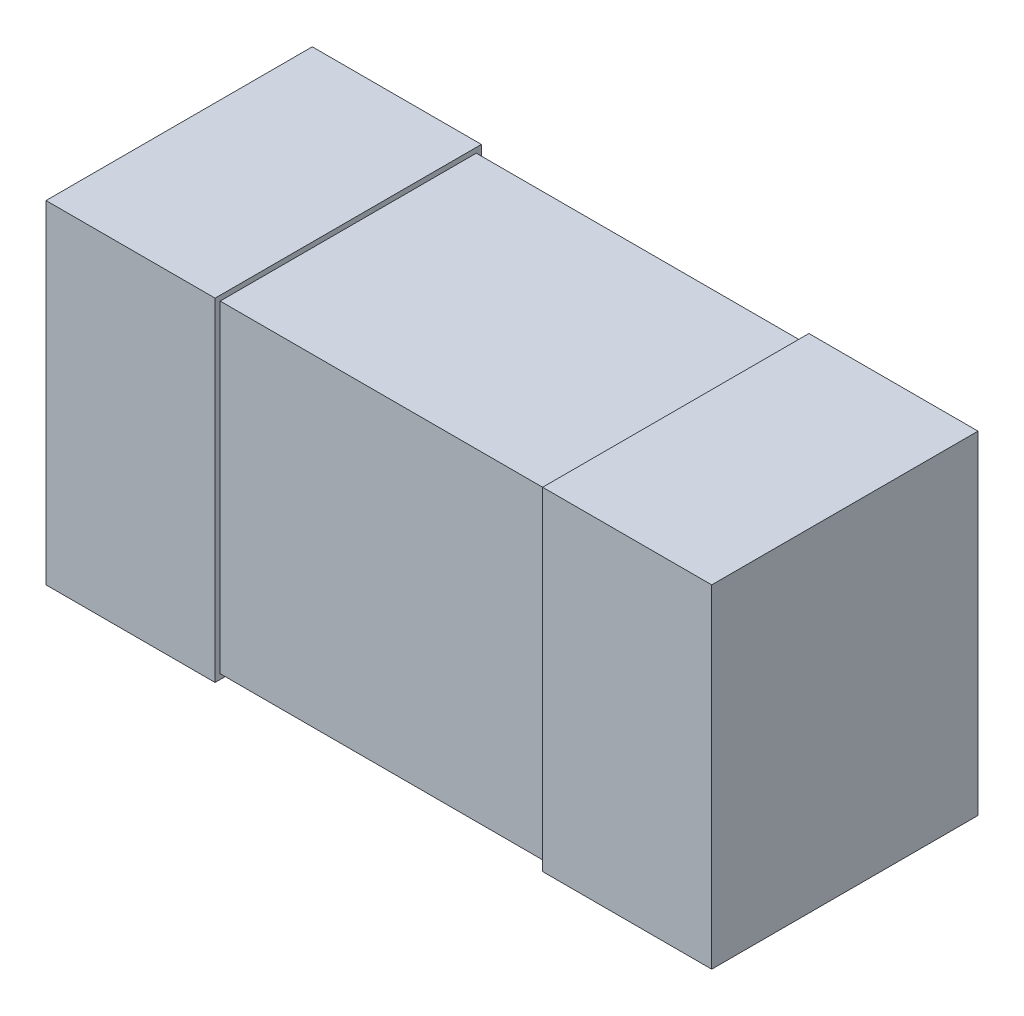
ISO-10303-21;
HEADER;
FILE_DESCRIPTION(('STEP AP214'),'2;1');
FILE_NAME('part.step','',(''),(''),'','','');
FILE_SCHEMA(('AUTOMOTIVE_DESIGN { 1 0 10303 214 1 1 1 1 }'));
ENDSEC;
DATA;
#1=APPLICATION_CONTEXT('core data for automotive mechanical design processes');
#2=APPLICATION_PROTOCOL_DEFINITION('international standard','automotive_design',2000,#1);
#3=PRODUCT_CONTEXT('',#1,'mechanical');
#4=PRODUCT('Part','Part','',(#3));
#5=PRODUCT_RELATED_PRODUCT_CATEGORY('part','',(#4));
#6=PRODUCT_DEFINITION_FORMATION('','',#4);
#7=PRODUCT_DEFINITION_CONTEXT('part definition',#1,'design');
#8=PRODUCT_DEFINITION('design','',#6,#7);
#9=PRODUCT_DEFINITION_SHAPE('','',#8);
#10=(LENGTH_UNIT() NAMED_UNIT(*) SI_UNIT(.MILLI.,.METRE.));
#11=(NAMED_UNIT(*) PLANE_ANGLE_UNIT() SI_UNIT($,.RADIAN.));
#12=(NAMED_UNIT(*) SI_UNIT($,.STERADIAN.) SOLID_ANGLE_UNIT());
#13=UNCERTAINTY_MEASURE_WITH_UNIT(LENGTH_MEASURE(1.E-05),#10,'distance_accuracy_value','');
#14=(GEOMETRIC_REPRESENTATION_CONTEXT(3) GLOBAL_UNCERTAINTY_ASSIGNED_CONTEXT((#13)) GLOBAL_UNIT_ASSIGNED_CONTEXT((#10,
#11,#12)) REPRESENTATION_CONTEXT('',''));
#15=CARTESIAN_POINT('',(0.,0.,0.));
#16=DIRECTION('',(0.,0.,1.));
#17=DIRECTION('',(1.,0.,0.));
#18=AXIS2_PLACEMENT_3D('',#15,#16,#17);
#19=CARTESIAN_POINT('',(0.5,-0.25,0.0762));
#20=DIRECTION('',(1.,0.,0.));
#21=DIRECTION('',(0.,1.,0.));
#22=AXIS2_PLACEMENT_3D('',#19,#20,#21);
#23=PLANE('',#22);
#24=DIRECTION('',(0.,0.,1.));
#25=VECTOR('',#24,1.);
#26=CARTESIAN_POINT('',(0.5,0.25,0.0762));
#27=LINE('',#26,#25);
#28=CARTESIAN_POINT('',(0.5,0.25,0.0762));
#29=VERTEX_POINT('',#28);
#30=CARTESIAN_POINT('',(0.5,0.25,0.4762));
#31=VERTEX_POINT('',#30);
#32=EDGE_CURVE('E172',#29,#31,#27,.T.);
#33=ORIENTED_EDGE('',*,*,#32,.T.);
#34=DIRECTION('',(0.,1.,0.));
#35=VECTOR('',#34,1.);
#36=CARTESIAN_POINT('',(0.5,-0.25,0.4762));
#37=LINE('',#36,#35);
#38=CARTESIAN_POINT('',(0.5,-0.25,0.4762));
#39=VERTEX_POINT('',#38);
#40=EDGE_CURVE('E179',#39,#31,#37,.T.);
#41=ORIENTED_EDGE('',*,*,#40,.F.);
#42=DIRECTION('',(0.,0.,1.));
#43=VECTOR('',#42,1.);
#44=CARTESIAN_POINT('',(0.5,-0.25,0.0762));
#45=LINE('',#44,#43);
#46=CARTESIAN_POINT('',(0.5,-0.25,0.0762));
#47=VERTEX_POINT('',#46);
#48=EDGE_CURVE('E11',#47,#39,#45,.T.);
#49=ORIENTED_EDGE('',*,*,#48,.F.);
#50=DIRECTION('',(0.,1.,0.));
#51=VECTOR('',#50,1.);
#52=CARTESIAN_POINT('',(0.5,-0.25,0.0762));
#53=LINE('',#52,#51);
#54=EDGE_CURVE('E154',#47,#29,#53,.T.);
#55=ORIENTED_EDGE('',*,*,#54,.T.);
#56=EDGE_LOOP('',(#33,#41,#49,#55));
#57=FACE_BOUND('',#56,.T.);
#58=ADVANCED_FACE('F18',(#57),#23,.T.);
#59=CARTESIAN_POINT('',(-0.5,0.25,0.0762));
#60=DIRECTION('',(-1.,0.,0.));
#61=DIRECTION('',(0.,0.,1.));
#62=AXIS2_PLACEMENT_3D('',#59,#60,#61);
#63=PLANE('',#62);
#64=DIRECTION('',(0.,0.,1.));
#65=VECTOR('',#64,1.);
#66=CARTESIAN_POINT('',(-0.5,-0.25,0.0762));
#67=LINE('',#66,#65);
#68=CARTESIAN_POINT('',(-0.5,-0.25,0.0762));
#69=VERTEX_POINT('',#68);
#70=CARTESIAN_POINT('',(-0.5,-0.25,0.4762));
#71=VERTEX_POINT('',#70);
#72=EDGE_CURVE('E29',#69,#71,#67,.T.);
#73=ORIENTED_EDGE('',*,*,#72,.T.);
#74=DIRECTION('',(0.,-1.,0.));
#75=VECTOR('',#74,1.);
#76=CARTESIAN_POINT('',(-0.5,0.25,0.4762));
#77=LINE('',#76,#75);
#78=CARTESIAN_POINT('',(-0.5,0.25,0.4762));
#79=VERTEX_POINT('',#78);
#80=EDGE_CURVE('E68',#79,#71,#77,.T.);
#81=ORIENTED_EDGE('',*,*,#80,.F.);
#82=DIRECTION('',(0.,0.,1.));
#83=VECTOR('',#82,1.);
#84=CARTESIAN_POINT('',(-0.5,0.25,0.0762));
#85=LINE('',#84,#83);
#86=CARTESIAN_POINT('',(-0.5,0.25,0.0762));
#87=VERTEX_POINT('',#86);
#88=EDGE_CURVE('E228',#87,#79,#85,.T.);
#89=ORIENTED_EDGE('',*,*,#88,.F.);
#90=DIRECTION('',(0.,-1.,0.));
#91=VECTOR('',#90,1.);
#92=CARTESIAN_POINT('',(-0.5,0.25,0.0762));
#93=LINE('',#92,#91);
#94=EDGE_CURVE('E199',#87,#69,#93,.T.);
#95=ORIENTED_EDGE('',*,*,#94,.T.);
#96=EDGE_LOOP('',(#73,#81,#89,#95));
#97=FACE_BOUND('',#96,.T.);
#98=ADVANCED_FACE('F614',(#97),#63,.T.);
#99=CARTESIAN_POINT('',(-0.5,-0.25,0.0762));
#100=DIRECTION('',(0.,-1.,0.));
#101=DIRECTION('',(0.,0.,-1.));
#102=AXIS2_PLACEMENT_3D('',#99,#100,#101);
#103=PLANE('',#102);
#104=DIRECTION('',(1.,0.,0.));
#105=VECTOR('',#104,1.);
#106=CARTESIAN_POINT('',(0.246,-0.25,0.0762));
#107=LINE('',#106,#105);
#108=CARTESIAN_POINT('',(0.246,-0.25,0.0762));
#109=VERTEX_POINT('',#108);
#110=EDGE_CURVE('E132',#109,#47,#107,.T.);
#111=ORIENTED_EDGE('',*,*,#110,.T.);
#112=ORIENTED_EDGE('',*,*,#48,.T.);
#113=DIRECTION('',(1.,0.,0.));
#114=VECTOR('',#113,1.);
#115=CARTESIAN_POINT('',(0.246,-0.25,0.4762));
#116=LINE('',#115,#114);
#117=CARTESIAN_POINT('',(0.246,-0.25,0.4762));
#118=VERTEX_POINT('',#117);
#119=EDGE_CURVE('E135',#118,#39,#116,.T.);
#120=ORIENTED_EDGE('',*,*,#119,.F.);
#121=DIRECTION('',(0.,0.,1.));
#122=VECTOR('',#121,1.);
#123=CARTESIAN_POINT('',(0.246,-0.25,0.0762));
#124=LINE('',#123,#122);
#125=EDGE_CURVE('E128',#109,#118,#124,.T.);
#126=ORIENTED_EDGE('',*,*,#125,.F.);
#127=EDGE_LOOP('',(#111,#112,#120,#126));
#128=FACE_BOUND('',#127,.T.);
#129=ADVANCED_FACE('F130',(#128),#103,.T.);
#130=CARTESIAN_POINT('',(-0.5,-0.25,0.0762));
#131=DIRECTION('',(0.,-1.,0.));
#132=DIRECTION('',(0.,0.,-1.));
#133=AXIS2_PLACEMENT_3D('',#130,#131,#132);
#134=PLANE('',#133);
#135=DIRECTION('',(1.,0.,0.));
#136=VECTOR('',#135,1.);
#137=CARTESIAN_POINT('',(-0.5,-0.25,0.4762));
#138=LINE('',#137,#136);
#139=CARTESIAN_POINT('',(-0.246,-0.25,0.4762));
#140=VERTEX_POINT('',#139);
#141=EDGE_CURVE('E211',#71,#140,#138,.T.);
#142=ORIENTED_EDGE('',*,*,#141,.F.);
#143=ORIENTED_EDGE('',*,*,#72,.F.);
#144=DIRECTION('',(1.,0.,0.));
#145=VECTOR('',#144,1.);
#146=CARTESIAN_POINT('',(-0.5,-0.25,0.0762));
#147=LINE('',#146,#145);
#148=CARTESIAN_POINT('',(-0.246,-0.25,0.0762));
#149=VERTEX_POINT('',#148);
#150=EDGE_CURVE('E203',#69,#149,#147,.T.);
#151=ORIENTED_EDGE('',*,*,#150,.T.);
#152=DIRECTION('',(0.,0.,1.));
#153=VECTOR('',#152,1.);
#154=CARTESIAN_POINT('',(-0.246,-0.25,0.0762));
#155=LINE('',#154,#153);
#156=EDGE_CURVE('E193',#149,#140,#155,.T.);
#157=ORIENTED_EDGE('',*,*,#156,.T.);
#158=EDGE_LOOP('',(#142,#143,#151,#157));
#159=FACE_BOUND('',#158,.T.);
#160=ADVANCED_FACE('F559',(#159),#134,.T.);
#161=CARTESIAN_POINT('',(0.,0.,0.4762));
#162=DIRECTION('',(0.,0.,1.));
#163=DIRECTION('',(1.,0.,0.));
#164=AXIS2_PLACEMENT_3D('',#161,#162,#163);
#165=PLANE('',#164);
#166=ORIENTED_EDGE('',*,*,#119,.T.);
#167=ORIENTED_EDGE('',*,*,#40,.T.);
#168=DIRECTION('',(-1.,0.,0.));
#169=VECTOR('',#168,1.);
#170=CARTESIAN_POINT('',(0.5,0.25,0.4762));
#171=LINE('',#170,#169);
#172=CARTESIAN_POINT('',(0.246,0.25,0.4762));
#173=VERTEX_POINT('',#172);
#174=EDGE_CURVE('E82',#31,#173,#171,.T.);
#175=ORIENTED_EDGE('',*,*,#174,.T.);
#176=DIRECTION('',(0.,1.,0.));
#177=VECTOR('',#176,1.);
#178=CARTESIAN_POINT('',(0.246,-0.25,0.4762));
#179=LINE('',#178,#177);
#180=EDGE_CURVE('E139',#118,#173,#179,.T.);
#181=ORIENTED_EDGE('',*,*,#180,.F.);
#182=EDGE_LOOP('',(#166,#167,#175,#181));
#183=FACE_BOUND('',#182,.T.);
#184=ADVANCED_FACE('F264',(#183),#165,.T.);
#185=CARTESIAN_POINT('',(0.,0.,0.4762));
#186=DIRECTION('',(0.,0.,1.));
#187=DIRECTION('',(1.,0.,0.));
#188=AXIS2_PLACEMENT_3D('',#185,#186,#187);
#189=PLANE('',#188);
#190=DIRECTION('',(-1.,0.,0.));
#191=VECTOR('',#190,1.);
#192=CARTESIAN_POINT('',(-0.246,0.25,0.4762));
#193=LINE('',#192,#191);
#194=CARTESIAN_POINT('',(-0.246,0.25,0.4762));
#195=VERTEX_POINT('',#194);
#196=EDGE_CURVE('E229',#195,#79,#193,.T.);
#197=ORIENTED_EDGE('',*,*,#196,.T.);
#198=ORIENTED_EDGE('',*,*,#80,.T.);
#199=ORIENTED_EDGE('',*,*,#141,.T.);
#200=DIRECTION('',(0.,1.,0.));
#201=VECTOR('',#200,1.);
#202=CARTESIAN_POINT('',(-0.246,-0.25,0.4762));
#203=LINE('',#202,#201);
#204=EDGE_CURVE('E197',#140,#195,#203,.T.);
#205=ORIENTED_EDGE('',*,*,#204,.T.);
#206=EDGE_LOOP('',(#197,#198,#199,#205));
#207=FACE_BOUND('',#206,.T.);
#208=ADVANCED_FACE('F558',(#207),#189,.T.);
#209=CARTESIAN_POINT('',(0.5,0.25,0.0762));
#210=DIRECTION('',(0.,1.,0.));
#211=DIRECTION('',(1.,0.,0.));
#212=AXIS2_PLACEMENT_3D('',#209,#210,#211);
#213=PLANE('',#212);
#214=ORIENTED_EDGE('',*,*,#174,.F.);
#215=ORIENTED_EDGE('',*,*,#32,.F.);
#216=DIRECTION('',(-1.,0.,0.));
#217=VECTOR('',#216,1.);
#218=CARTESIAN_POINT('',(0.5,0.25,0.0762));
#219=LINE('',#218,#217);
#220=CARTESIAN_POINT('',(0.246,0.25,0.0762));
#221=VERTEX_POINT('',#220);
#222=EDGE_CURVE('E163',#29,#221,#219,.T.);
#223=ORIENTED_EDGE('',*,*,#222,.T.);
#224=DIRECTION('',(0.,0.,1.));
#225=VECTOR('',#224,1.);
#226=CARTESIAN_POINT('',(0.246,0.25,0.0762));
#227=LINE('',#226,#225);
#228=EDGE_CURVE('E146',#221,#173,#227,.T.);
#229=ORIENTED_EDGE('',*,*,#228,.T.);
#230=EDGE_LOOP('',(#214,#215,#223,#229));
#231=FACE_BOUND('',#230,.T.);
#232=ADVANCED_FACE('F267',(#231),#213,.T.);
#233=CARTESIAN_POINT('',(0.5,0.25,0.0762));
#234=DIRECTION('',(0.,1.,0.));
#235=DIRECTION('',(1.,0.,0.));
#236=AXIS2_PLACEMENT_3D('',#233,#234,#235);
#237=PLANE('',#236);
#238=DIRECTION('',(-1.,0.,0.));
#239=VECTOR('',#238,1.);
#240=CARTESIAN_POINT('',(-0.246,0.25,0.0762));
#241=LINE('',#240,#239);
#242=CARTESIAN_POINT('',(-0.246,0.25,0.0762));
#243=VERTEX_POINT('',#242);
#244=EDGE_CURVE('E22',#243,#87,#241,.T.);
#245=ORIENTED_EDGE('',*,*,#244,.T.);
#246=ORIENTED_EDGE('',*,*,#88,.T.);
#247=ORIENTED_EDGE('',*,*,#196,.F.);
#248=DIRECTION('',(0.,0.,1.));
#249=VECTOR('',#248,1.);
#250=CARTESIAN_POINT('',(-0.246,0.25,0.0762));
#251=LINE('',#250,#249);
#252=EDGE_CURVE('E151',#243,#195,#251,.T.);
#253=ORIENTED_EDGE('',*,*,#252,.F.);
#254=EDGE_LOOP('',(#245,#246,#247,#253));
#255=FACE_BOUND('',#254,.T.);
#256=ADVANCED_FACE('F625',(#255),#237,.T.);
#257=CARTESIAN_POINT('',(0.246,-0.25,0.08382));
#258=DIRECTION('',(1.,0.,0.));
#259=DIRECTION('',(0.,1.,0.));
#260=AXIS2_PLACEMENT_3D('',#257,#258,#259);
#261=PLANE('',#260);
#262=DIRECTION('',(0.,0.,1.));
#263=VECTOR('',#262,1.);
#264=CARTESIAN_POINT('',(0.246,0.24238,0.08382));
#265=LINE('',#264,#263);
#266=CARTESIAN_POINT('',(0.246,0.24238,0.08382));
#267=VERTEX_POINT('',#266);
#268=CARTESIAN_POINT('',(0.246,0.24238,0.46858));
#269=VERTEX_POINT('',#268);
#270=EDGE_CURVE('E188',#267,#269,#265,.T.);
#271=ORIENTED_EDGE('',*,*,#270,.T.);
#272=DIRECTION('',(0.,-1.,0.));
#273=VECTOR('',#272,1.);
#274=CARTESIAN_POINT('',(0.246,0.24238,0.46858));
#275=LINE('',#274,#273);
#276=CARTESIAN_POINT('',(0.246,-0.24238,0.46858));
#277=VERTEX_POINT('',#276);
#278=EDGE_CURVE('E170',#269,#277,#275,.T.);
#279=ORIENTED_EDGE('',*,*,#278,.T.);
#280=DIRECTION('',(0.,0.,-1.));
#281=VECTOR('',#280,1.);
#282=CARTESIAN_POINT('',(0.246,-0.24238,0.46858));
#283=LINE('',#282,#281);
#284=CARTESIAN_POINT('',(0.246,-0.24238,0.08382));
#285=VERTEX_POINT('',#284);
#286=EDGE_CURVE('E171',#277,#285,#283,.T.);
#287=ORIENTED_EDGE('',*,*,#286,.T.);
#288=DIRECTION('',(0.,1.,0.));
#289=VECTOR('',#288,1.);
#290=CARTESIAN_POINT('',(0.246,-0.24238,0.08382));
#291=LINE('',#290,#289);
#292=EDGE_CURVE('E140',#285,#267,#291,.T.);
#293=ORIENTED_EDGE('',*,*,#292,.T.);
#294=EDGE_LOOP('',(#271,#279,#287,#293));
#295=FACE_BOUND('',#294,.T.);
#296=ORIENTED_EDGE('',*,*,#125,.T.);
#297=ORIENTED_EDGE('',*,*,#180,.T.);
#298=ORIENTED_EDGE('',*,*,#228,.F.);
#299=DIRECTION('',(0.,1.,0.));
#300=VECTOR('',#299,1.);
#301=CARTESIAN_POINT('',(0.246,-0.25,0.0762));
#302=LINE('',#301,#300);
#303=EDGE_CURVE('E144',#109,#221,#302,.T.);
#304=ORIENTED_EDGE('',*,*,#303,.F.);
#305=EDGE_LOOP('',(#296,#297,#298,#304));
#306=FACE_BOUND('',#305,.T.);
#307=ADVANCED_FACE('F145',(#295,#306),#261,.F.);
#308=CARTESIAN_POINT('',(-0.246,-0.25,0.08382));
#309=DIRECTION('',(0.,0.,1.));
#310=DIRECTION('',(1.,0.,0.));
#311=AXIS2_PLACEMENT_3D('',#308,#309,#310);
#312=PLANE('',#311);
#313=DIRECTION('',(0.,1.,0.));
#314=VECTOR('',#313,1.);
#315=CARTESIAN_POINT('',(-0.246,-0.24238,0.08382));
#316=LINE('',#315,#314);
#317=CARTESIAN_POINT('',(-0.246,-0.24238,0.08382));
#318=VERTEX_POINT('',#317);
#319=CARTESIAN_POINT('',(-0.246,0.24238,0.08382));
#320=VERTEX_POINT('',#319);
#321=EDGE_CURVE('E225',#318,#320,#316,.T.);
#322=ORIENTED_EDGE('',*,*,#321,.T.);
#323=DIRECTION('',(1.,0.,0.));
#324=VECTOR('',#323,1.);
#325=CARTESIAN_POINT('',(-0.246,0.24238,0.08382));
#326=LINE('',#325,#324);
#327=EDGE_CURVE('E184',#320,#267,#326,.T.);
#328=ORIENTED_EDGE('',*,*,#327,.T.);
#329=ORIENTED_EDGE('',*,*,#292,.F.);
#330=DIRECTION('',(1.,0.,0.));
#331=VECTOR('',#330,1.);
#332=CARTESIAN_POINT('',(-0.246,-0.24238,0.08382));
#333=LINE('',#332,#331);
#334=EDGE_CURVE('E192',#318,#285,#333,.T.);
#335=ORIENTED_EDGE('',*,*,#334,.F.);
#336=EDGE_LOOP('',(#322,#328,#329,#335));
#337=FACE_BOUND('',#336,.T.);
#338=ADVANCED_FACE('F295',(#337),#312,.F.);
#339=CARTESIAN_POINT('',(-0.246,0.24238,0.0762));
#340=DIRECTION('',(0.,-1.,0.));
#341=DIRECTION('',(0.,0.,-1.));
#342=AXIS2_PLACEMENT_3D('',#339,#340,#341);
#343=PLANE('',#342);
#344=DIRECTION('',(0.,0.,1.));
#345=VECTOR('',#344,1.);
#346=CARTESIAN_POINT('',(-0.246,0.24238,0.08382));
#347=LINE('',#346,#345);
#348=CARTESIAN_POINT('',(-0.246,0.24238,0.46858));
#349=VERTEX_POINT('',#348);
#350=EDGE_CURVE('E238',#320,#349,#347,.T.);
#351=ORIENTED_EDGE('',*,*,#350,.T.);
#352=DIRECTION('',(1.,0.,0.));
#353=VECTOR('',#352,1.);
#354=CARTESIAN_POINT('',(-0.246,0.24238,0.46858));
#355=LINE('',#354,#353);
#356=EDGE_CURVE('E205',#349,#269,#355,.T.);
#357=ORIENTED_EDGE('',*,*,#356,.T.);
#358=ORIENTED_EDGE('',*,*,#270,.F.);
#359=ORIENTED_EDGE('',*,*,#327,.F.);
#360=EDGE_LOOP('',(#351,#357,#358,#359));
#361=FACE_BOUND('',#360,.T.);
#362=ADVANCED_FACE('F284',(#361),#343,.F.);
#363=CARTESIAN_POINT('',(-0.246,0.25,0.46858));
#364=DIRECTION('',(0.,0.,-1.));
#365=DIRECTION('',(0.,-1.,0.));
#366=AXIS2_PLACEMENT_3D('',#363,#364,#365);
#367=PLANE('',#366);
#368=DIRECTION('',(0.,-1.,0.));
#369=VECTOR('',#368,1.);
#370=CARTESIAN_POINT('',(-0.246,0.24238,0.46858));
#371=LINE('',#370,#369);
#372=CARTESIAN_POINT('',(-0.246,-0.24238,0.46858));
#373=VERTEX_POINT('',#372);
#374=EDGE_CURVE('E196',#349,#373,#371,.T.);
#375=ORIENTED_EDGE('',*,*,#374,.T.);
#376=DIRECTION('',(1.,0.,0.));
#377=VECTOR('',#376,1.);
#378=CARTESIAN_POINT('',(-0.246,-0.24238,0.46858));
#379=LINE('',#378,#377);
#380=EDGE_CURVE('E167',#373,#277,#379,.T.);
#381=ORIENTED_EDGE('',*,*,#380,.T.);
#382=ORIENTED_EDGE('',*,*,#278,.F.);
#383=ORIENTED_EDGE('',*,*,#356,.F.);
#384=EDGE_LOOP('',(#375,#381,#382,#383));
#385=FACE_BOUND('',#384,.T.);
#386=ADVANCED_FACE('F288',(#385),#367,.F.);
#387=CARTESIAN_POINT('',(-0.246,-0.24238,0.4762));
#388=DIRECTION('',(0.,1.,0.));
#389=DIRECTION('',(1.,0.,0.));
#390=AXIS2_PLACEMENT_3D('',#387,#388,#389);
#391=PLANE('',#390);
#392=DIRECTION('',(0.,0.,-1.));
#393=VECTOR('',#392,1.);
#394=CARTESIAN_POINT('',(-0.246,-0.24238,0.46858));
#395=LINE('',#394,#393);
#396=EDGE_CURVE('E221',#373,#318,#395,.T.);
#397=ORIENTED_EDGE('',*,*,#396,.T.);
#398=ORIENTED_EDGE('',*,*,#334,.T.);
#399=ORIENTED_EDGE('',*,*,#286,.F.);
#400=ORIENTED_EDGE('',*,*,#380,.F.);
#401=EDGE_LOOP('',(#397,#398,#399,#400));
#402=FACE_BOUND('',#401,.T.);
#403=ADVANCED_FACE('F292',(#402),#391,.F.);
#404=CARTESIAN_POINT('',(-0.246,-0.25,0.0762));
#405=DIRECTION('',(-1.,0.,0.));
#406=DIRECTION('',(0.,0.,1.));
#407=AXIS2_PLACEMENT_3D('',#404,#405,#406);
#408=PLANE('',#407);
#409=ORIENTED_EDGE('',*,*,#374,.F.);
#410=ORIENTED_EDGE('',*,*,#350,.F.);
#411=ORIENTED_EDGE('',*,*,#321,.F.);
#412=ORIENTED_EDGE('',*,*,#396,.F.);
#413=EDGE_LOOP('',(#409,#410,#411,#412));
#414=FACE_BOUND('',#413,.T.);
#415=ORIENTED_EDGE('',*,*,#252,.T.);
#416=ORIENTED_EDGE('',*,*,#204,.F.);
#417=ORIENTED_EDGE('',*,*,#156,.F.);
#418=DIRECTION('',(0.,1.,0.));
#419=VECTOR('',#418,1.);
#420=CARTESIAN_POINT('',(-0.246,-0.25,0.0762));
#421=LINE('',#420,#419);
#422=EDGE_CURVE('E178',#149,#243,#421,.T.);
#423=ORIENTED_EDGE('',*,*,#422,.T.);
#424=EDGE_LOOP('',(#415,#416,#417,#423));
#425=FACE_BOUND('',#424,.T.);
#426=ADVANCED_FACE('F297',(#414,#425),#408,.F.);
#427=CARTESIAN_POINT('',(0.,0.,0.0762));
#428=DIRECTION('',(0.,0.,1.));
#429=DIRECTION('',(1.,0.,0.));
#430=AXIS2_PLACEMENT_3D('',#427,#428,#429);
#431=PLANE('',#430);
#432=ORIENTED_EDGE('',*,*,#222,.F.);
#433=ORIENTED_EDGE('',*,*,#54,.F.);
#434=ORIENTED_EDGE('',*,*,#110,.F.);
#435=ORIENTED_EDGE('',*,*,#303,.T.);
#436=EDGE_LOOP('',(#432,#433,#434,#435));
#437=FACE_BOUND('',#436,.T.);
#438=ADVANCED_FACE('F20',(#437),#431,.F.);
#439=CARTESIAN_POINT('',(0.,0.,0.0762));
#440=DIRECTION('',(0.,0.,1.));
#441=DIRECTION('',(1.,0.,0.));
#442=AXIS2_PLACEMENT_3D('',#439,#440,#441);
#443=PLANE('',#442);
#444=ORIENTED_EDGE('',*,*,#150,.F.);
#445=ORIENTED_EDGE('',*,*,#94,.F.);
#446=ORIENTED_EDGE('',*,*,#244,.F.);
#447=ORIENTED_EDGE('',*,*,#422,.F.);
#448=EDGE_LOOP('',(#444,#445,#446,#447));
#449=FACE_BOUND('',#448,.T.);
#450=ADVANCED_FACE('F543',(#449),#443,.F.);
#451=CLOSED_SHELL('',(#58,#98,#129,#160,#184,#208,#232,#256,#307,#338,#362,#386,#403,#426,#438,#450));
#452=MANIFOLD_SOLID_BREP('B1',#451);
#453=ADVANCED_BREP_SHAPE_REPRESENTATION('',(#18,#452),#14);
#454=SHAPE_DEFINITION_REPRESENTATION(#9,#453);
ENDSEC;
END-ISO-10303-21;
